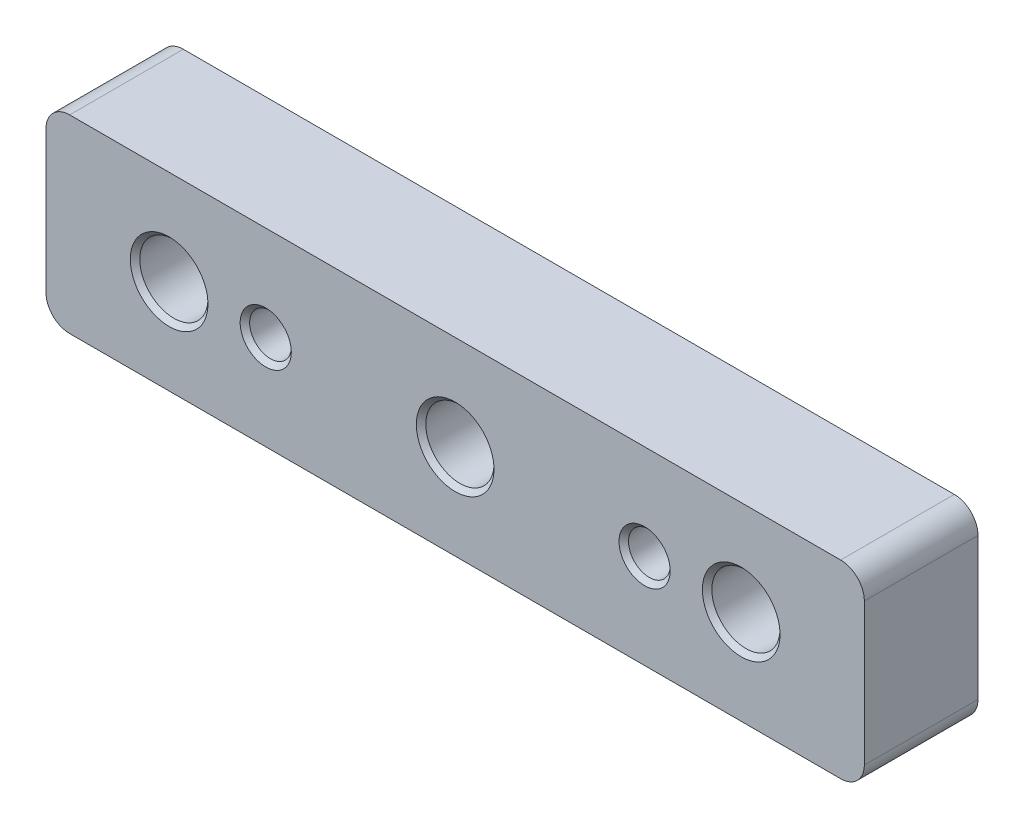
ISO-10303-21;
HEADER;
FILE_DESCRIPTION(('STEP AP214'),'2;1');
FILE_NAME('part.step','',(''),(''),'','','');
FILE_SCHEMA(('AUTOMOTIVE_DESIGN { 1 0 10303 214 1 1 1 1 }'));
ENDSEC;
DATA;
#1=APPLICATION_CONTEXT('core data for automotive mechanical design processes');
#2=APPLICATION_PROTOCOL_DEFINITION('international standard','automotive_design',2000,#1);
#3=PRODUCT_CONTEXT('',#1,'mechanical');
#4=PRODUCT('Part','Part','',(#3));
#5=PRODUCT_RELATED_PRODUCT_CATEGORY('part','',(#4));
#6=PRODUCT_DEFINITION_FORMATION('','',#4);
#7=PRODUCT_DEFINITION_CONTEXT('part definition',#1,'design');
#8=PRODUCT_DEFINITION('design','',#6,#7);
#9=PRODUCT_DEFINITION_SHAPE('','',#8);
#10=(LENGTH_UNIT() NAMED_UNIT(*) SI_UNIT(.MILLI.,.METRE.));
#11=(NAMED_UNIT(*) PLANE_ANGLE_UNIT() SI_UNIT($,.RADIAN.));
#12=(NAMED_UNIT(*) SI_UNIT($,.STERADIAN.) SOLID_ANGLE_UNIT());
#13=UNCERTAINTY_MEASURE_WITH_UNIT(LENGTH_MEASURE(1.E-05),#10,'distance_accuracy_value','');
#14=(GEOMETRIC_REPRESENTATION_CONTEXT(3) GLOBAL_UNCERTAINTY_ASSIGNED_CONTEXT((#13)) GLOBAL_UNIT_ASSIGNED_CONTEXT((#10,
#11,#12)) REPRESENTATION_CONTEXT('',''));
#15=CARTESIAN_POINT('',(0.,0.,0.));
#16=DIRECTION('',(0.,0.,1.));
#17=DIRECTION('',(1.,0.,0.));
#18=AXIS2_PLACEMENT_3D('',#15,#16,#17);
#19=CARTESIAN_POINT('',(38.923645958376,11.2695183128221,4.00744833123645));
#20=DIRECTION('',(0.,0.,-1.));
#21=DIRECTION('',(-1.,0.,0.));
#22=AXIS2_PLACEMENT_3D('',#19,#20,#21);
#23=PLANE('',#22);
#24=CARTESIAN_POINT('',(28.423645958376,3.76951831282213,4.00744833123645));
#25=DIRECTION('',(0.,0.,-1.));
#26=DIRECTION('',(-1.,0.,0.));
#27=AXIS2_PLACEMENT_3D('',#24,#25,#26);
#28=CIRCLE('',#27,4.10000000000002);
#29=CARTESIAN_POINT('',(24.323645958376,3.76951831282213,4.00744833123645));
#30=VERTEX_POINT('',#29);
#31=EDGE_CURVE('E10',#30,#30,#28,.T.);
#32=ORIENTED_EDGE('',*,*,#31,.T.);
#33=EDGE_LOOP('',(#32));
#34=FACE_BOUND('',#33,.T.);
#35=CARTESIAN_POINT('',(-1.77635404162402,3.76951831282213,4.00744833123645));
#36=DIRECTION('',(0.,0.,-1.));
#37=DIRECTION('',(-1.,0.,0.));
#38=AXIS2_PLACEMENT_3D('',#35,#36,#37);
#39=CIRCLE('',#38,4.10000000000002);
#40=CARTESIAN_POINT('',(-5.87635404162404,3.76951831282213,4.00744833123645));
#41=VERTEX_POINT('',#40);
#42=EDGE_CURVE('E25',#41,#41,#39,.T.);
#43=ORIENTED_EDGE('',*,*,#42,.T.);
#44=EDGE_LOOP('',(#43));
#45=FACE_BOUND('',#44,.T.);
#46=CARTESIAN_POINT('',(-31.976354041624,3.76951831282213,4.00744833123645));
#47=DIRECTION('',(0.,0.,-1.));
#48=DIRECTION('',(-1.,0.,0.));
#49=AXIS2_PLACEMENT_3D('',#46,#47,#48);
#50=CIRCLE('',#49,4.10000000000002);
#51=CARTESIAN_POINT('',(-36.076354041624,3.76951831282213,4.00744833123645));
#52=VERTEX_POINT('',#51);
#53=EDGE_CURVE('E182',#52,#52,#50,.T.);
#54=ORIENTED_EDGE('',*,*,#53,.T.);
#55=EDGE_LOOP('',(#54));
#56=FACE_BOUND('',#55,.T.);
#57=CARTESIAN_POINT('',(-21.776354041624,3.76951831282213,4.00744833123645));
#58=DIRECTION('',(0.,0.,1.));
#59=DIRECTION('',(1.,0.,0.));
#60=AXIS2_PLACEMENT_3D('',#57,#58,#59);
#61=CIRCLE('',#60,2.7);
#62=CARTESIAN_POINT('',(-19.076354041624,3.76951831282213,4.00744833123645));
#63=VERTEX_POINT('',#62);
#64=EDGE_CURVE('E478',#63,#63,#61,.T.);
#65=ORIENTED_EDGE('',*,*,#64,.F.);
#66=EDGE_LOOP('',(#65));
#67=FACE_BOUND('',#66,.T.);
#68=CARTESIAN_POINT('',(18.223645958376,3.76951831282213,4.00744833123645));
#69=DIRECTION('',(0.,0.,1.));
#70=DIRECTION('',(1.,0.,0.));
#71=AXIS2_PLACEMENT_3D('',#68,#69,#70);
#72=CIRCLE('',#71,2.7);
#73=CARTESIAN_POINT('',(20.923645958376,3.76951831282213,4.00744833123645));
#74=VERTEX_POINT('',#73);
#75=EDGE_CURVE('E453',#74,#74,#72,.T.);
#76=ORIENTED_EDGE('',*,*,#75,.F.);
#77=EDGE_LOOP('',(#76));
#78=FACE_BOUND('',#77,.T.);
#79=CARTESIAN_POINT('',(38.923645958376,11.2695183128221,4.00744833123645));
#80=DIRECTION('',(0.,0.,1.));
#81=DIRECTION('',(-1.,0.,0.));
#82=AXIS2_PLACEMENT_3D('',#79,#80,#81);
#83=CIRCLE('',#82,2.5);
#84=CARTESIAN_POINT('',(41.423645958376,11.2695183128221,4.00744833123645));
#85=VERTEX_POINT('',#84);
#86=CARTESIAN_POINT('',(38.923645958376,13.7695183128221,4.00744833123645));
#87=VERTEX_POINT('',#86);
#88=EDGE_CURVE('E128',#85,#87,#83,.T.);
#89=ORIENTED_EDGE('',*,*,#88,.T.);
#90=DIRECTION('',(-1.,0.,0.));
#91=VECTOR('',#90,1.);
#92=CARTESIAN_POINT('',(-42.476354041624,13.7695183128221,4.00744833123645));
#93=LINE('',#92,#91);
#94=CARTESIAN_POINT('',(-42.476354041624,13.7695183128221,4.00744833123645));
#95=VERTEX_POINT('',#94);
#96=EDGE_CURVE('E77',#87,#95,#93,.T.);
#97=ORIENTED_EDGE('',*,*,#96,.T.);
#98=CARTESIAN_POINT('',(-42.476354041624,11.2695183128221,4.00744833123645));
#99=DIRECTION('',(0.,0.,1.));
#100=DIRECTION('',(-1.,0.,0.));
#101=AXIS2_PLACEMENT_3D('',#98,#99,#100);
#102=CIRCLE('',#101,2.5);
#103=CARTESIAN_POINT('',(-44.976354041624,11.2695183128221,4.00744833123645));
#104=VERTEX_POINT('',#103);
#105=EDGE_CURVE('E462',#95,#104,#102,.T.);
#106=ORIENTED_EDGE('',*,*,#105,.T.);
#107=DIRECTION('',(0.,-1.,0.));
#108=VECTOR('',#107,1.);
#109=CARTESIAN_POINT('',(-44.976354041624,11.2695183128221,4.00744833123645));
#110=LINE('',#109,#108);
#111=CARTESIAN_POINT('',(-44.976354041624,-3.73048168717787,4.00744833123645));
#112=VERTEX_POINT('',#111);
#113=EDGE_CURVE('E464',#104,#112,#110,.T.);
#114=ORIENTED_EDGE('',*,*,#113,.T.);
#115=CARTESIAN_POINT('',(-42.476354041624,-3.73048168717787,4.00744833123645));
#116=DIRECTION('',(0.,0.,1.));
#117=DIRECTION('',(-1.,0.,0.));
#118=AXIS2_PLACEMENT_3D('',#115,#116,#117);
#119=CIRCLE('',#118,2.5);
#120=CARTESIAN_POINT('',(-42.476354041624,-6.23048168717787,4.00744833123645));
#121=VERTEX_POINT('',#120);
#122=EDGE_CURVE('E95',#112,#121,#119,.T.);
#123=ORIENTED_EDGE('',*,*,#122,.T.);
#124=DIRECTION('',(1.,0.,0.));
#125=VECTOR('',#124,1.);
#126=CARTESIAN_POINT('',(-42.476354041624,-6.23048168717787,4.00744833123645));
#127=LINE('',#126,#125);
#128=CARTESIAN_POINT('',(38.923645958376,-6.23048168717787,4.00744833123645));
#129=VERTEX_POINT('',#128);
#130=EDGE_CURVE('E90',#121,#129,#127,.T.);
#131=ORIENTED_EDGE('',*,*,#130,.T.);
#132=CARTESIAN_POINT('',(38.923645958376,-3.73048168717787,4.00744833123645));
#133=DIRECTION('',(0.,0.,1.));
#134=DIRECTION('',(-1.,0.,0.));
#135=AXIS2_PLACEMENT_3D('',#132,#133,#134);
#136=CIRCLE('',#135,2.5);
#137=CARTESIAN_POINT('',(41.423645958376,-3.73048168717787,4.00744833123645));
#138=VERTEX_POINT('',#137);
#139=EDGE_CURVE('E93',#129,#138,#136,.T.);
#140=ORIENTED_EDGE('',*,*,#139,.T.);
#141=DIRECTION('',(0.,1.,0.));
#142=VECTOR('',#141,1.);
#143=CARTESIAN_POINT('',(41.423645958376,11.2695183128221,4.00744833123645));
#144=LINE('',#143,#142);
#145=EDGE_CURVE('E33',#138,#85,#144,.T.);
#146=ORIENTED_EDGE('',*,*,#145,.T.);
#147=EDGE_LOOP('',(#89,#97,#106,#114,#123,#131,#140,#146));
#148=FACE_BOUND('',#147,.T.);
#149=ADVANCED_FACE('F16',(#34,#45,#56,#67,#78,#148),#23,.F.);
#150=CARTESIAN_POINT('',(38.923645958376,11.2695183128221,-7.99255166876355));
#151=DIRECTION('',(0.,0.,-1.));
#152=DIRECTION('',(-1.,0.,0.));
#153=AXIS2_PLACEMENT_3D('',#150,#151,#152);
#154=PLANE('',#153);
#155=CARTESIAN_POINT('',(-21.776354041624,3.76951831282213,-7.99255166876355));
#156=DIRECTION('',(0.,0.,-1.));
#157=DIRECTION('',(-1.,0.,0.));
#158=AXIS2_PLACEMENT_3D('',#155,#156,#157);
#159=CIRCLE('',#158,2.69999999999997);
#160=CARTESIAN_POINT('',(-24.476354041624,3.76951831282213,-7.99255166876355));
#161=VERTEX_POINT('',#160);
#162=EDGE_CURVE('E155',#161,#161,#159,.F.);
#163=ORIENTED_EDGE('',*,*,#162,.T.);
#164=EDGE_LOOP('',(#163));
#165=FACE_BOUND('',#164,.T.);
#166=CARTESIAN_POINT('',(18.223645958376,3.76951831282213,-7.99255166876355));
#167=DIRECTION('',(0.,0.,-1.));
#168=DIRECTION('',(-1.,0.,0.));
#169=AXIS2_PLACEMENT_3D('',#166,#167,#168);
#170=CIRCLE('',#169,2.69999999999999);
#171=CARTESIAN_POINT('',(15.523645958376,3.76951831282213,-7.99255166876355));
#172=VERTEX_POINT('',#171);
#173=EDGE_CURVE('E152',#172,#172,#170,.F.);
#174=ORIENTED_EDGE('',*,*,#173,.T.);
#175=EDGE_LOOP('',(#174));
#176=FACE_BOUND('',#175,.T.);
#177=CARTESIAN_POINT('',(28.423645958376,3.76951831282213,-7.99255166876355));
#178=DIRECTION('',(0.,0.,-1.));
#179=DIRECTION('',(-1.,0.,0.));
#180=AXIS2_PLACEMENT_3D('',#177,#178,#179);
#181=CIRCLE('',#180,4.09999999999999);
#182=CARTESIAN_POINT('',(24.323645958376,3.76951831282213,-7.99255166876355));
#183=VERTEX_POINT('',#182);
#184=EDGE_CURVE('E149',#183,#183,#181,.F.);
#185=ORIENTED_EDGE('',*,*,#184,.T.);
#186=EDGE_LOOP('',(#185));
#187=FACE_BOUND('',#186,.T.);
#188=CARTESIAN_POINT('',(-1.77635404162402,3.76951831282213,-7.99255166876355));
#189=DIRECTION('',(0.,0.,-1.));
#190=DIRECTION('',(-1.,0.,0.));
#191=AXIS2_PLACEMENT_3D('',#188,#189,#190);
#192=CIRCLE('',#191,4.09999999999999);
#193=CARTESIAN_POINT('',(-5.87635404162401,3.76951831282213,-7.99255166876355));
#194=VERTEX_POINT('',#193);
#195=EDGE_CURVE('E146',#194,#194,#192,.F.);
#196=ORIENTED_EDGE('',*,*,#195,.T.);
#197=EDGE_LOOP('',(#196));
#198=FACE_BOUND('',#197,.T.);
#199=CARTESIAN_POINT('',(-31.976354041624,3.76951831282213,-7.99255166876355));
#200=DIRECTION('',(0.,0.,-1.));
#201=DIRECTION('',(-1.,0.,0.));
#202=AXIS2_PLACEMENT_3D('',#199,#200,#201);
#203=CIRCLE('',#202,4.09999999999999);
#204=CARTESIAN_POINT('',(-36.076354041624,3.76951831282213,-7.99255166876355));
#205=VERTEX_POINT('',#204);
#206=EDGE_CURVE('E143',#205,#205,#203,.F.);
#207=ORIENTED_EDGE('',*,*,#206,.T.);
#208=EDGE_LOOP('',(#207));
#209=FACE_BOUND('',#208,.T.);
#210=CARTESIAN_POINT('',(38.923645958376,11.2695183128221,-7.99255166876355));
#211=DIRECTION('',(0.,0.,1.));
#212=DIRECTION('',(-1.,0.,0.));
#213=AXIS2_PLACEMENT_3D('',#210,#211,#212);
#214=CIRCLE('',#213,2.5);
#215=CARTESIAN_POINT('',(41.423645958376,11.2695183128221,-7.99255166876355));
#216=VERTEX_POINT('',#215);
#217=CARTESIAN_POINT('',(38.923645958376,13.7695183128221,-7.99255166876355));
#218=VERTEX_POINT('',#217);
#219=EDGE_CURVE('E113',#216,#218,#214,.T.);
#220=ORIENTED_EDGE('',*,*,#219,.F.);
#221=DIRECTION('',(0.,1.,0.));
#222=VECTOR('',#221,1.);
#223=CARTESIAN_POINT('',(41.423645958376,11.2695183128221,-7.99255166876355));
#224=LINE('',#223,#222);
#225=CARTESIAN_POINT('',(41.423645958376,-3.73048168717787,-7.99255166876355));
#226=VERTEX_POINT('',#225);
#227=EDGE_CURVE('E68',#226,#216,#224,.T.);
#228=ORIENTED_EDGE('',*,*,#227,.F.);
#229=CARTESIAN_POINT('',(38.923645958376,-3.73048168717787,-7.99255166876355));
#230=DIRECTION('',(0.,0.,1.));
#231=DIRECTION('',(-1.,0.,0.));
#232=AXIS2_PLACEMENT_3D('',#229,#230,#231);
#233=CIRCLE('',#232,2.5);
#234=CARTESIAN_POINT('',(38.923645958376,-6.23048168717787,-7.99255166876355));
#235=VERTEX_POINT('',#234);
#236=EDGE_CURVE('E62',#235,#226,#233,.T.);
#237=ORIENTED_EDGE('',*,*,#236,.F.);
#238=DIRECTION('',(1.,0.,0.));
#239=VECTOR('',#238,1.);
#240=CARTESIAN_POINT('',(-42.476354041624,-6.23048168717787,-7.99255166876355));
#241=LINE('',#240,#239);
#242=CARTESIAN_POINT('',(-42.476354041624,-6.23048168717787,-7.99255166876355));
#243=VERTEX_POINT('',#242);
#244=EDGE_CURVE('E103',#243,#235,#241,.T.);
#245=ORIENTED_EDGE('',*,*,#244,.F.);
#246=CARTESIAN_POINT('',(-42.476354041624,-3.73048168717787,-7.99255166876355));
#247=DIRECTION('',(0.,0.,1.));
#248=DIRECTION('',(-1.,0.,0.));
#249=AXIS2_PLACEMENT_3D('',#246,#247,#248);
#250=CIRCLE('',#249,2.5);
#251=CARTESIAN_POINT('',(-44.976354041624,-3.73048168717787,-7.99255166876355));
#252=VERTEX_POINT('',#251);
#253=EDGE_CURVE('E123',#252,#243,#250,.T.);
#254=ORIENTED_EDGE('',*,*,#253,.F.);
#255=DIRECTION('',(0.,-1.,0.));
#256=VECTOR('',#255,1.);
#257=CARTESIAN_POINT('',(-44.976354041624,11.2695183128221,-7.99255166876355));
#258=LINE('',#257,#256);
#259=CARTESIAN_POINT('',(-44.976354041624,11.2695183128221,-7.99255166876355));
#260=VERTEX_POINT('',#259);
#261=EDGE_CURVE('E121',#260,#252,#258,.T.);
#262=ORIENTED_EDGE('',*,*,#261,.F.);
#263=CARTESIAN_POINT('',(-42.476354041624,11.2695183128221,-7.99255166876355));
#264=DIRECTION('',(0.,0.,1.));
#265=DIRECTION('',(-1.,0.,0.));
#266=AXIS2_PLACEMENT_3D('',#263,#264,#265);
#267=CIRCLE('',#266,2.5);
#268=CARTESIAN_POINT('',(-42.476354041624,13.7695183128221,-7.99255166876355));
#269=VERTEX_POINT('',#268);
#270=EDGE_CURVE('E119',#269,#260,#267,.T.);
#271=ORIENTED_EDGE('',*,*,#270,.F.);
#272=DIRECTION('',(-1.,0.,0.));
#273=VECTOR('',#272,1.);
#274=CARTESIAN_POINT('',(-42.476354041624,13.7695183128221,-7.99255166876355));
#275=LINE('',#274,#273);
#276=EDGE_CURVE('E116',#218,#269,#275,.T.);
#277=ORIENTED_EDGE('',*,*,#276,.F.);
#278=EDGE_LOOP('',(#220,#228,#237,#245,#254,#262,#271,#277));
#279=FACE_BOUND('',#278,.T.);
#280=ADVANCED_FACE('F213',(#165,#176,#187,#198,#209,#279),#154,.T.);
#281=CARTESIAN_POINT('',(38.923645958376,11.2695183128221,4.00744833123645));
#282=DIRECTION('',(0.,0.,-1.));
#283=DIRECTION('',(-1.,0.,0.));
#284=AXIS2_PLACEMENT_3D('',#281,#282,#283);
#285=CYLINDRICAL_SURFACE('',#284,2.5);
#286=ORIENTED_EDGE('',*,*,#219,.T.);
#287=DIRECTION('',(0.,0.,-1.));
#288=VECTOR('',#287,1.);
#289=CARTESIAN_POINT('',(38.923645958376,13.7695183128221,4.00744833123645));
#290=LINE('',#289,#288);
#291=EDGE_CURVE('E141',#87,#218,#290,.T.);
#292=ORIENTED_EDGE('',*,*,#291,.F.);
#293=ORIENTED_EDGE('',*,*,#88,.F.);
#294=DIRECTION('',(0.,0.,-1.));
#295=VECTOR('',#294,1.);
#296=CARTESIAN_POINT('',(41.423645958376,11.2695183128221,4.00744833123645));
#297=LINE('',#296,#295);
#298=EDGE_CURVE('E109',#85,#216,#297,.T.);
#299=ORIENTED_EDGE('',*,*,#298,.T.);
#300=EDGE_LOOP('',(#286,#292,#293,#299));
#301=FACE_BOUND('',#300,.T.);
#302=ADVANCED_FACE('F219',(#301),#285,.T.);
#303=CARTESIAN_POINT('',(-42.476354041624,13.7695183128221,4.00744833123645));
#304=DIRECTION('',(0.,-1.,0.));
#305=DIRECTION('',(0.,0.,-1.));
#306=AXIS2_PLACEMENT_3D('',#303,#304,#305);
#307=PLANE('',#306);
#308=ORIENTED_EDGE('',*,*,#276,.T.);
#309=DIRECTION('',(0.,0.,-1.));
#310=VECTOR('',#309,1.);
#311=CARTESIAN_POINT('',(-42.476354041624,13.7695183128221,4.00744833123645));
#312=LINE('',#311,#310);
#313=EDGE_CURVE('E138',#95,#269,#312,.T.);
#314=ORIENTED_EDGE('',*,*,#313,.F.);
#315=ORIENTED_EDGE('',*,*,#96,.F.);
#316=ORIENTED_EDGE('',*,*,#291,.T.);
#317=EDGE_LOOP('',(#308,#314,#315,#316));
#318=FACE_BOUND('',#317,.T.);
#319=ADVANCED_FACE('F240',(#318),#307,.F.);
#320=CARTESIAN_POINT('',(-42.476354041624,11.2695183128221,4.00744833123645));
#321=DIRECTION('',(0.,0.,-1.));
#322=DIRECTION('',(-1.,0.,0.));
#323=AXIS2_PLACEMENT_3D('',#320,#321,#322);
#324=CYLINDRICAL_SURFACE('',#323,2.5);
#325=ORIENTED_EDGE('',*,*,#270,.T.);
#326=DIRECTION('',(0.,0.,-1.));
#327=VECTOR('',#326,1.);
#328=CARTESIAN_POINT('',(-44.976354041624,11.2695183128221,4.00744833123645));
#329=LINE('',#328,#327);
#330=EDGE_CURVE('E135',#104,#260,#329,.T.);
#331=ORIENTED_EDGE('',*,*,#330,.F.);
#332=ORIENTED_EDGE('',*,*,#105,.F.);
#333=ORIENTED_EDGE('',*,*,#313,.T.);
#334=EDGE_LOOP('',(#325,#331,#332,#333));
#335=FACE_BOUND('',#334,.T.);
#336=ADVANCED_FACE('F236',(#335),#324,.T.);
#337=CARTESIAN_POINT('',(-44.976354041624,11.2695183128221,4.00744833123645));
#338=DIRECTION('',(1.,0.,0.));
#339=DIRECTION('',(0.,0.,-1.));
#340=AXIS2_PLACEMENT_3D('',#337,#338,#339);
#341=PLANE('',#340);
#342=ORIENTED_EDGE('',*,*,#261,.T.);
#343=DIRECTION('',(0.,0.,-1.));
#344=VECTOR('',#343,1.);
#345=CARTESIAN_POINT('',(-44.976354041624,-3.73048168717787,4.00744833123645));
#346=LINE('',#345,#344);
#347=EDGE_CURVE('E132',#112,#252,#346,.T.);
#348=ORIENTED_EDGE('',*,*,#347,.F.);
#349=ORIENTED_EDGE('',*,*,#113,.F.);
#350=ORIENTED_EDGE('',*,*,#330,.T.);
#351=EDGE_LOOP('',(#342,#348,#349,#350));
#352=FACE_BOUND('',#351,.T.);
#353=ADVANCED_FACE('F232',(#352),#341,.F.);
#354=CARTESIAN_POINT('',(-42.476354041624,-3.73048168717787,4.00744833123645));
#355=DIRECTION('',(0.,0.,-1.));
#356=DIRECTION('',(-1.,0.,0.));
#357=AXIS2_PLACEMENT_3D('',#354,#355,#356);
#358=CYLINDRICAL_SURFACE('',#357,2.5);
#359=ORIENTED_EDGE('',*,*,#253,.T.);
#360=DIRECTION('',(0.,0.,-1.));
#361=VECTOR('',#360,1.);
#362=CARTESIAN_POINT('',(-42.476354041624,-6.23048168717787,4.00744833123645));
#363=LINE('',#362,#361);
#364=EDGE_CURVE('E104',#121,#243,#363,.T.);
#365=ORIENTED_EDGE('',*,*,#364,.F.);
#366=ORIENTED_EDGE('',*,*,#122,.F.);
#367=ORIENTED_EDGE('',*,*,#347,.T.);
#368=EDGE_LOOP('',(#359,#365,#366,#367));
#369=FACE_BOUND('',#368,.T.);
#370=ADVANCED_FACE('F229',(#369),#358,.T.);
#371=CARTESIAN_POINT('',(-42.476354041624,-6.23048168717787,4.00744833123645));
#372=DIRECTION('',(0.,1.,0.));
#373=DIRECTION('',(0.,0.,1.));
#374=AXIS2_PLACEMENT_3D('',#371,#372,#373);
#375=PLANE('',#374);
#376=ORIENTED_EDGE('',*,*,#244,.T.);
#377=DIRECTION('',(0.,0.,-1.));
#378=VECTOR('',#377,1.);
#379=CARTESIAN_POINT('',(38.923645958376,-6.23048168717787,4.00744833123645));
#380=LINE('',#379,#378);
#381=EDGE_CURVE('E100',#129,#235,#380,.T.);
#382=ORIENTED_EDGE('',*,*,#381,.F.);
#383=ORIENTED_EDGE('',*,*,#130,.F.);
#384=ORIENTED_EDGE('',*,*,#364,.T.);
#385=EDGE_LOOP('',(#376,#382,#383,#384));
#386=FACE_BOUND('',#385,.T.);
#387=ADVANCED_FACE('F101',(#386),#375,.F.);
#388=CARTESIAN_POINT('',(38.923645958376,-3.73048168717787,4.00744833123645));
#389=DIRECTION('',(0.,0.,-1.));
#390=DIRECTION('',(-1.,0.,0.));
#391=AXIS2_PLACEMENT_3D('',#388,#389,#390);
#392=CYLINDRICAL_SURFACE('',#391,2.5);
#393=ORIENTED_EDGE('',*,*,#236,.T.);
#394=DIRECTION('',(0.,0.,-1.));
#395=VECTOR('',#394,1.);
#396=CARTESIAN_POINT('',(41.423645958376,-3.73048168717787,4.00744833123645));
#397=LINE('',#396,#395);
#398=EDGE_CURVE('E105',#138,#226,#397,.T.);
#399=ORIENTED_EDGE('',*,*,#398,.F.);
#400=ORIENTED_EDGE('',*,*,#139,.F.);
#401=ORIENTED_EDGE('',*,*,#381,.T.);
#402=EDGE_LOOP('',(#393,#399,#400,#401));
#403=FACE_BOUND('',#402,.T.);
#404=ADVANCED_FACE('F107',(#403),#392,.T.);
#405=CARTESIAN_POINT('',(41.423645958376,11.2695183128221,4.00744833123645));
#406=DIRECTION('',(-1.,0.,0.));
#407=DIRECTION('',(0.,0.,1.));
#408=AXIS2_PLACEMENT_3D('',#405,#406,#407);
#409=PLANE('',#408);
#410=ORIENTED_EDGE('',*,*,#227,.T.);
#411=ORIENTED_EDGE('',*,*,#298,.F.);
#412=ORIENTED_EDGE('',*,*,#145,.F.);
#413=ORIENTED_EDGE('',*,*,#398,.T.);
#414=EDGE_LOOP('',(#410,#411,#412,#413));
#415=FACE_BOUND('',#414,.T.);
#416=ADVANCED_FACE('F209',(#415),#409,.F.);
#417=CARTESIAN_POINT('',(28.423645958376,3.76951831282213,4.00744833123645));
#418=DIRECTION('',(0.,0.,-1.));
#419=DIRECTION('',(-1.,0.,0.));
#420=AXIS2_PLACEMENT_3D('',#417,#418,#419);
#421=CYLINDRICAL_SURFACE('',#420,3.6);
#422=CARTESIAN_POINT('',(28.423645958376,3.76951831282213,-7.49255166876356));
#423=DIRECTION('',(0.,0.,-1.));
#424=DIRECTION('',(-1.,0.,0.));
#425=AXIS2_PLACEMENT_3D('',#422,#423,#424);
#426=CIRCLE('',#425,3.6);
#427=CARTESIAN_POINT('',(24.823645958376,3.76951831282213,-7.49255166876356));
#428=VERTEX_POINT('',#427);
#429=EDGE_CURVE('E167',#428,#428,#426,.T.);
#430=ORIENTED_EDGE('',*,*,#429,.T.);
#431=EDGE_LOOP('',(#430));
#432=FACE_BOUND('',#431,.T.);
#433=CARTESIAN_POINT('',(28.423645958376,3.76951831282213,3.50744833123643));
#434=DIRECTION('',(0.,0.,-1.));
#435=DIRECTION('',(-1.,0.,0.));
#436=AXIS2_PLACEMENT_3D('',#433,#434,#435);
#437=CIRCLE('',#436,3.6);
#438=CARTESIAN_POINT('',(24.823645958376,3.76951831282213,3.50744833123643));
#439=VERTEX_POINT('',#438);
#440=EDGE_CURVE('E164',#439,#439,#437,.F.);
#441=ORIENTED_EDGE('',*,*,#440,.T.);
#442=EDGE_LOOP('',(#441));
#443=FACE_BOUND('',#442,.T.);
#444=ADVANCED_FACE('F198',(#432,#443),#421,.F.);
#445=CARTESIAN_POINT('',(-1.77635404162402,3.76951831282213,4.00744833123645));
#446=DIRECTION('',(0.,0.,-1.));
#447=DIRECTION('',(-1.,0.,0.));
#448=AXIS2_PLACEMENT_3D('',#445,#446,#447);
#449=CYLINDRICAL_SURFACE('',#448,3.6);
#450=CARTESIAN_POINT('',(-1.77635404162402,3.76951831282213,-7.49255166876356));
#451=DIRECTION('',(0.,0.,-1.));
#452=DIRECTION('',(-1.,0.,0.));
#453=AXIS2_PLACEMENT_3D('',#450,#451,#452);
#454=CIRCLE('',#453,3.6);
#455=CARTESIAN_POINT('',(-5.37635404162402,3.76951831282213,-7.49255166876356));
#456=VERTEX_POINT('',#455);
#457=EDGE_CURVE('E173',#456,#456,#454,.T.);
#458=ORIENTED_EDGE('',*,*,#457,.T.);
#459=EDGE_LOOP('',(#458));
#460=FACE_BOUND('',#459,.T.);
#461=CARTESIAN_POINT('',(-1.77635404162402,3.76951831282213,3.50744833123641));
#462=DIRECTION('',(0.,0.,-1.));
#463=DIRECTION('',(-1.,0.,0.));
#464=AXIS2_PLACEMENT_3D('',#461,#462,#463);
#465=CIRCLE('',#464,3.6);
#466=CARTESIAN_POINT('',(-5.37635404162402,3.76951831282213,3.50744833123641));
#467=VERTEX_POINT('',#466);
#468=EDGE_CURVE('E170',#467,#467,#465,.F.);
#469=ORIENTED_EDGE('',*,*,#468,.T.);
#470=EDGE_LOOP('',(#469));
#471=FACE_BOUND('',#470,.T.);
#472=ADVANCED_FACE('F195',(#460,#471),#449,.F.);
#473=CARTESIAN_POINT('',(-31.976354041624,3.76951831282213,4.00744833123645));
#474=DIRECTION('',(0.,0.,-1.));
#475=DIRECTION('',(-1.,0.,0.));
#476=AXIS2_PLACEMENT_3D('',#473,#474,#475);
#477=CYLINDRICAL_SURFACE('',#476,3.6);
#478=CARTESIAN_POINT('',(-31.976354041624,3.76951831282213,-7.49255166876356));
#479=DIRECTION('',(0.,0.,-1.));
#480=DIRECTION('',(-1.,0.,0.));
#481=AXIS2_PLACEMENT_3D('',#478,#479,#480);
#482=CIRCLE('',#481,3.6);
#483=CARTESIAN_POINT('',(-35.576354041624,3.76951831282213,-7.49255166876356));
#484=VERTEX_POINT('',#483);
#485=EDGE_CURVE('E179',#484,#484,#482,.T.);
#486=ORIENTED_EDGE('',*,*,#485,.T.);
#487=EDGE_LOOP('',(#486));
#488=FACE_BOUND('',#487,.T.);
#489=CARTESIAN_POINT('',(-31.976354041624,3.76951831282213,3.50744833123641));
#490=DIRECTION('',(0.,0.,-1.));
#491=DIRECTION('',(-1.,0.,0.));
#492=AXIS2_PLACEMENT_3D('',#489,#490,#491);
#493=CIRCLE('',#492,3.6);
#494=CARTESIAN_POINT('',(-35.576354041624,3.76951831282213,3.50744833123641));
#495=VERTEX_POINT('',#494);
#496=EDGE_CURVE('E176',#495,#495,#493,.F.);
#497=ORIENTED_EDGE('',*,*,#496,.T.);
#498=EDGE_LOOP('',(#497));
#499=FACE_BOUND('',#498,.T.);
#500=ADVANCED_FACE('F197',(#488,#499),#477,.F.);
#501=CARTESIAN_POINT('',(18.223645958376,3.76951831282213,4.00744833123645));
#502=DIRECTION('',(0.,0.,1.));
#503=DIRECTION('',(1.,0.,0.));
#504=AXIS2_PLACEMENT_3D('',#501,#502,#503);
#505=CYLINDRICAL_SURFACE('',#504,2.2);
#506=CARTESIAN_POINT('',(18.223645958376,3.76951831282213,-7.49255166876355));
#507=DIRECTION('',(0.,0.,-1.));
#508=DIRECTION('',(-1.,0.,0.));
#509=AXIS2_PLACEMENT_3D('',#506,#507,#508);
#510=CIRCLE('',#509,2.2);
#511=CARTESIAN_POINT('',(16.023645958376,3.76951831282213,-7.49255166876355));
#512=VERTEX_POINT('',#511);
#513=EDGE_CURVE('E161',#512,#512,#510,.T.);
#514=ORIENTED_EDGE('',*,*,#513,.T.);
#515=EDGE_LOOP('',(#514));
#516=FACE_BOUND('',#515,.T.);
#517=CARTESIAN_POINT('',(18.223645958376,3.76951831282213,3.50744833123645));
#518=DIRECTION('',(0.,0.,1.));
#519=DIRECTION('',(1.,0.,0.));
#520=AXIS2_PLACEMENT_3D('',#517,#518,#519);
#521=CIRCLE('',#520,2.2);
#522=CARTESIAN_POINT('',(20.423645958376,3.76951831282213,3.50744833123645));
#523=VERTEX_POINT('',#522);
#524=EDGE_CURVE('E117',#523,#523,#521,.T.);
#525=ORIENTED_EDGE('',*,*,#524,.T.);
#526=EDGE_LOOP('',(#525));
#527=FACE_BOUND('',#526,.T.);
#528=ADVANCED_FACE('F206',(#516,#527),#505,.F.);
#529=CARTESIAN_POINT('',(18.223645958376,3.76951831282213,4.00744833123645));
#530=DIRECTION('',(0.,0.,1.));
#531=DIRECTION('',(1.,0.,0.));
#532=AXIS2_PLACEMENT_3D('',#529,#530,#531);
#533=CONICAL_SURFACE('',#532,2.7,0.785398163397452);
#534=ORIENTED_EDGE('',*,*,#524,.F.);
#535=EDGE_LOOP('',(#534));
#536=FACE_BOUND('',#535,.T.);
#537=ORIENTED_EDGE('',*,*,#75,.T.);
#538=EDGE_LOOP('',(#537));
#539=FACE_BOUND('',#538,.T.);
#540=ADVANCED_FACE('F342',(#536,#539),#533,.F.);
#541=CARTESIAN_POINT('',(-21.776354041624,3.76951831282213,4.00744833123645));
#542=DIRECTION('',(0.,0.,1.));
#543=DIRECTION('',(1.,0.,0.));
#544=AXIS2_PLACEMENT_3D('',#541,#542,#543);
#545=CYLINDRICAL_SURFACE('',#544,2.2);
#546=CARTESIAN_POINT('',(-21.776354041624,3.76951831282213,-7.49255166876357));
#547=DIRECTION('',(0.,0.,-1.));
#548=DIRECTION('',(-1.,0.,0.));
#549=AXIS2_PLACEMENT_3D('',#546,#547,#548);
#550=CIRCLE('',#549,2.2);
#551=CARTESIAN_POINT('',(-23.976354041624,3.76951831282213,-7.49255166876357));
#552=VERTEX_POINT('',#551);
#553=EDGE_CURVE('E158',#552,#552,#550,.T.);
#554=ORIENTED_EDGE('',*,*,#553,.T.);
#555=EDGE_LOOP('',(#554));
#556=FACE_BOUND('',#555,.T.);
#557=CARTESIAN_POINT('',(-21.776354041624,3.76951831282213,3.50744833123645));
#558=DIRECTION('',(0.,0.,1.));
#559=DIRECTION('',(1.,0.,0.));
#560=AXIS2_PLACEMENT_3D('',#557,#558,#559);
#561=CIRCLE('',#560,2.2);
#562=CARTESIAN_POINT('',(-19.576354041624,3.76951831282213,3.50744833123645));
#563=VERTEX_POINT('',#562);
#564=EDGE_CURVE('E456',#563,#563,#561,.T.);
#565=ORIENTED_EDGE('',*,*,#564,.T.);
#566=EDGE_LOOP('',(#565));
#567=FACE_BOUND('',#566,.T.);
#568=ADVANCED_FACE('F333',(#556,#567),#545,.F.);
#569=CARTESIAN_POINT('',(-21.776354041624,3.76951831282213,4.00744833123645));
#570=DIRECTION('',(0.,0.,1.));
#571=DIRECTION('',(1.,0.,0.));
#572=AXIS2_PLACEMENT_3D('',#569,#570,#571);
#573=CONICAL_SURFACE('',#572,2.7,0.785398163397452);
#574=ORIENTED_EDGE('',*,*,#564,.F.);
#575=EDGE_LOOP('',(#574));
#576=FACE_BOUND('',#575,.T.);
#577=ORIENTED_EDGE('',*,*,#64,.T.);
#578=EDGE_LOOP('',(#577));
#579=FACE_BOUND('',#578,.T.);
#580=ADVANCED_FACE('F251',(#576,#579),#573,.F.);
#581=CARTESIAN_POINT('',(-21.776354041624,3.76951831282213,-7.99255166876355));
#582=DIRECTION('',(0.,0.,-1.));
#583=DIRECTION('',(-1.,0.,0.));
#584=AXIS2_PLACEMENT_3D('',#581,#582,#583);
#585=CONICAL_SURFACE('',#584,2.69999999999997,0.785398163397443);
#586=ORIENTED_EDGE('',*,*,#553,.F.);
#587=EDGE_LOOP('',(#586));
#588=FACE_BOUND('',#587,.T.);
#589=ORIENTED_EDGE('',*,*,#162,.F.);
#590=EDGE_LOOP('',(#589));
#591=FACE_BOUND('',#590,.T.);
#592=ADVANCED_FACE('F247',(#588,#591),#585,.F.);
#593=CARTESIAN_POINT('',(18.223645958376,3.76951831282213,-7.99255166876355));
#594=DIRECTION('',(0.,0.,-1.));
#595=DIRECTION('',(-1.,0.,0.));
#596=AXIS2_PLACEMENT_3D('',#593,#594,#595);
#597=CONICAL_SURFACE('',#596,2.69999999999999,0.785398163397436);
#598=ORIENTED_EDGE('',*,*,#513,.F.);
#599=EDGE_LOOP('',(#598));
#600=FACE_BOUND('',#599,.T.);
#601=ORIENTED_EDGE('',*,*,#173,.F.);
#602=EDGE_LOOP('',(#601));
#603=FACE_BOUND('',#602,.T.);
#604=ADVANCED_FACE('F250',(#600,#603),#597,.F.);
#605=CARTESIAN_POINT('',(28.423645958376,3.76951831282213,-7.99255166876355));
#606=DIRECTION('',(0.,0.,-1.));
#607=DIRECTION('',(-1.,0.,0.));
#608=AXIS2_PLACEMENT_3D('',#605,#606,#607);
#609=CONICAL_SURFACE('',#608,4.09999999999999,0.785398163397438);
#610=ORIENTED_EDGE('',*,*,#429,.F.);
#611=EDGE_LOOP('',(#610));
#612=FACE_BOUND('',#611,.T.);
#613=ORIENTED_EDGE('',*,*,#184,.F.);
#614=EDGE_LOOP('',(#613));
#615=FACE_BOUND('',#614,.T.);
#616=ADVANCED_FACE('F255',(#612,#615),#609,.F.);
#617=CARTESIAN_POINT('',(-1.77635404162402,3.76951831282213,-7.99255166876355));
#618=DIRECTION('',(0.,0.,-1.));
#619=DIRECTION('',(-1.,0.,0.));
#620=AXIS2_PLACEMENT_3D('',#617,#618,#619);
#621=CONICAL_SURFACE('',#620,4.09999999999999,0.785398163397447);
#622=ORIENTED_EDGE('',*,*,#457,.F.);
#623=EDGE_LOOP('',(#622));
#624=FACE_BOUND('',#623,.T.);
#625=ORIENTED_EDGE('',*,*,#195,.F.);
#626=EDGE_LOOP('',(#625));
#627=FACE_BOUND('',#626,.T.);
#628=ADVANCED_FACE('F259',(#624,#627),#621,.F.);
#629=CARTESIAN_POINT('',(-31.976354041624,3.76951831282213,-7.99255166876355));
#630=DIRECTION('',(0.,0.,-1.));
#631=DIRECTION('',(-1.,0.,0.));
#632=AXIS2_PLACEMENT_3D('',#629,#630,#631);
#633=CONICAL_SURFACE('',#632,4.09999999999999,0.785398163397445);
#634=ORIENTED_EDGE('',*,*,#485,.F.);
#635=EDGE_LOOP('',(#634));
#636=FACE_BOUND('',#635,.T.);
#637=ORIENTED_EDGE('',*,*,#206,.F.);
#638=EDGE_LOOP('',(#637));
#639=FACE_BOUND('',#638,.T.);
#640=ADVANCED_FACE('F263',(#636,#639),#633,.F.);
#641=CARTESIAN_POINT('',(28.423645958376,3.76951831282213,3.50744833123643));
#642=DIRECTION('',(0.,0.,1.));
#643=DIRECTION('',(1.,0.,0.));
#644=AXIS2_PLACEMENT_3D('',#641,#642,#643);
#645=CONICAL_SURFACE('',#644,3.6,0.78539816339745);
#646=ORIENTED_EDGE('',*,*,#31,.F.);
#647=EDGE_LOOP('',(#646));
#648=FACE_BOUND('',#647,.T.);
#649=ORIENTED_EDGE('',*,*,#440,.F.);
#650=EDGE_LOOP('',(#649));
#651=FACE_BOUND('',#650,.T.);
#652=ADVANCED_FACE('F192',(#648,#651),#645,.F.);
#653=CARTESIAN_POINT('',(-1.77635404162402,3.76951831282213,3.50744833123641));
#654=DIRECTION('',(0.,0.,1.));
#655=DIRECTION('',(1.,0.,0.));
#656=AXIS2_PLACEMENT_3D('',#653,#654,#655);
#657=CONICAL_SURFACE('',#656,3.6,0.785398163397435);
#658=ORIENTED_EDGE('',*,*,#42,.F.);
#659=EDGE_LOOP('',(#658));
#660=FACE_BOUND('',#659,.T.);
#661=ORIENTED_EDGE('',*,*,#468,.F.);
#662=EDGE_LOOP('',(#661));
#663=FACE_BOUND('',#662,.T.);
#664=ADVANCED_FACE('F189',(#660,#663),#657,.F.);
#665=CARTESIAN_POINT('',(-31.976354041624,3.76951831282213,3.50744833123641));
#666=DIRECTION('',(0.,0.,1.));
#667=DIRECTION('',(1.,0.,0.));
#668=AXIS2_PLACEMENT_3D('',#665,#666,#667);
#669=CONICAL_SURFACE('',#668,3.6,0.785398163397436);
#670=ORIENTED_EDGE('',*,*,#53,.F.);
#671=EDGE_LOOP('',(#670));
#672=FACE_BOUND('',#671,.T.);
#673=ORIENTED_EDGE('',*,*,#496,.F.);
#674=EDGE_LOOP('',(#673));
#675=FACE_BOUND('',#674,.T.);
#676=ADVANCED_FACE('F18',(#672,#675),#669,.F.);
#677=CLOSED_SHELL('',(#149,#280,#302,#319,#336,#353,#370,#387,#404,#416,#444,#472,#500,#528,
#540,#568,#580,#592,#604,#616,#628,#640,#652,#664,#676));
#678=MANIFOLD_SOLID_BREP('B1',#677);
#679=ADVANCED_BREP_SHAPE_REPRESENTATION('',(#18,#678),#14);
#680=SHAPE_DEFINITION_REPRESENTATION(#9,#679);
ENDSEC;
END-ISO-10303-21;
